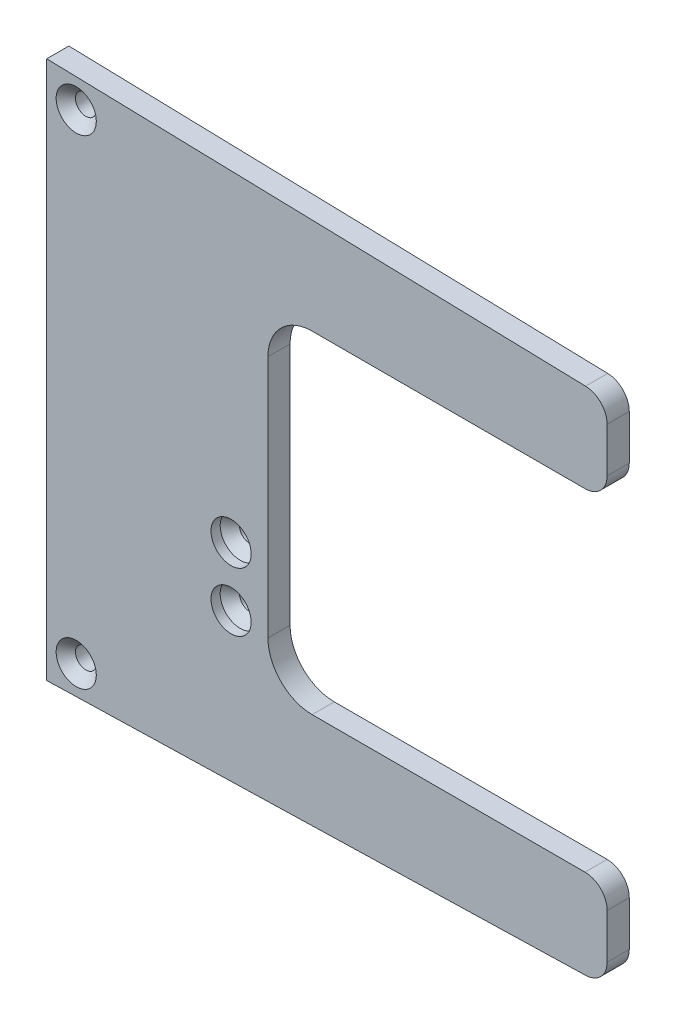
ISO-10303-21;
HEADER;
FILE_DESCRIPTION(('STEP AP214'),'2;1');
FILE_NAME('part.step','',(''),(''),'','','');
FILE_SCHEMA(('AUTOMOTIVE_DESIGN { 1 0 10303 214 1 1 1 1 }'));
ENDSEC;
DATA;
#1=APPLICATION_CONTEXT('core data for automotive mechanical design processes');
#2=APPLICATION_PROTOCOL_DEFINITION('international standard','automotive_design',2000,#1);
#3=PRODUCT_CONTEXT('',#1,'mechanical');
#4=PRODUCT('Part','Part','',(#3));
#5=PRODUCT_RELATED_PRODUCT_CATEGORY('part','',(#4));
#6=PRODUCT_DEFINITION_FORMATION('','',#4);
#7=PRODUCT_DEFINITION_CONTEXT('part definition',#1,'design');
#8=PRODUCT_DEFINITION('design','',#6,#7);
#9=PRODUCT_DEFINITION_SHAPE('','',#8);
#10=(LENGTH_UNIT() NAMED_UNIT(*) SI_UNIT(.MILLI.,.METRE.));
#11=(NAMED_UNIT(*) PLANE_ANGLE_UNIT() SI_UNIT($,.RADIAN.));
#12=(NAMED_UNIT(*) SI_UNIT($,.STERADIAN.) SOLID_ANGLE_UNIT());
#13=UNCERTAINTY_MEASURE_WITH_UNIT(LENGTH_MEASURE(1.E-05),#10,'distance_accuracy_value','');
#14=(GEOMETRIC_REPRESENTATION_CONTEXT(3) GLOBAL_UNCERTAINTY_ASSIGNED_CONTEXT((#13)) GLOBAL_UNIT_ASSIGNED_CONTEXT((#10,
#11,#12)) REPRESENTATION_CONTEXT('',''));
#15=CARTESIAN_POINT('',(0.,0.,0.));
#16=DIRECTION('',(0.,0.,1.));
#17=DIRECTION('',(1.,0.,0.));
#18=AXIS2_PLACEMENT_3D('',#15,#16,#17);
#19=CARTESIAN_POINT('',(-47.625,115.91925,9.525));
#20=DIRECTION('',(1.,0.,0.));
#21=DIRECTION('',(0.,1.,0.));
#22=AXIS2_PLACEMENT_3D('',#19,#20,#21);
#23=PLANE('',#22);
#24=DIRECTION('',(0.,-1.,0.));
#25=VECTOR('',#24,1.);
#26=CARTESIAN_POINT('',(-47.625,115.91925,0.));
#27=LINE('',#26,#25);
#28=CARTESIAN_POINT('',(-47.625,115.91925,0.));
#29=VERTEX_POINT('',#28);
#30=CARTESIAN_POINT('',(-47.625,-115.91925,0.));
#31=VERTEX_POINT('',#30);
#32=EDGE_CURVE('E167',#29,#31,#27,.T.);
#33=ORIENTED_EDGE('',*,*,#32,.T.);
#34=DIRECTION('',(0.,0.,-1.));
#35=VECTOR('',#34,1.);
#36=CARTESIAN_POINT('',(-47.625,-115.91925,9.525));
#37=LINE('',#36,#35);
#38=CARTESIAN_POINT('',(-47.625,-115.91925,9.525));
#39=VERTEX_POINT('',#38);
#40=EDGE_CURVE('E145',#39,#31,#37,.T.);
#41=ORIENTED_EDGE('',*,*,#40,.F.);
#42=DIRECTION('',(0.,-1.,0.));
#43=VECTOR('',#42,1.);
#44=CARTESIAN_POINT('',(-47.625,115.91925,9.525));
#45=LINE('',#44,#43);
#46=CARTESIAN_POINT('',(-47.625,115.91925,9.525));
#47=VERTEX_POINT('',#46);
#48=EDGE_CURVE('E155',#47,#39,#45,.T.);
#49=ORIENTED_EDGE('',*,*,#48,.F.);
#50=DIRECTION('',(0.,0.,-1.));
#51=VECTOR('',#50,1.);
#52=CARTESIAN_POINT('',(-47.625,115.91925,9.525));
#53=LINE('',#52,#51);
#54=EDGE_CURVE('E169',#47,#29,#53,.T.);
#55=ORIENTED_EDGE('',*,*,#54,.T.);
#56=EDGE_LOOP('',(#33,#41,#49,#55));
#57=FACE_BOUND('',#56,.T.);
#58=ADVANCED_FACE('F39',(#57),#23,.F.);
#59=CARTESIAN_POINT('',(47.625,115.91925,9.525));
#60=DIRECTION('',(-1.,0.,0.));
#61=DIRECTION('',(0.,-1.,0.));
#62=AXIS2_PLACEMENT_3D('',#59,#60,#61);
#63=PLANE('',#62);
#64=DIRECTION('',(0.,1.,0.));
#65=VECTOR('',#64,1.);
#66=CARTESIAN_POINT('',(47.625,115.91925,9.525));
#67=LINE('',#66,#65);
#68=CARTESIAN_POINT('',(47.625,-52.4505871253568,9.525));
#69=VERTEX_POINT('',#68);
#70=CARTESIAN_POINT('',(47.625,52.4505871253569,9.525));
#71=VERTEX_POINT('',#70);
#72=EDGE_CURVE('E162',#69,#71,#67,.T.);
#73=ORIENTED_EDGE('',*,*,#72,.F.);
#74=DIRECTION('',(0.,0.,1.));
#75=VECTOR('',#74,1.);
#76=CARTESIAN_POINT('',(47.625,-52.4505871253569,9.525));
#77=LINE('',#76,#75);
#78=CARTESIAN_POINT('',(47.625,-52.4505871253568,0.));
#79=VERTEX_POINT('',#78);
#80=EDGE_CURVE('E234',#69,#79,#77,.F.);
#81=ORIENTED_EDGE('',*,*,#80,.T.);
#82=DIRECTION('',(0.,1.,0.));
#83=VECTOR('',#82,1.);
#84=CARTESIAN_POINT('',(47.625,115.91925,0.));
#85=LINE('',#84,#83);
#86=CARTESIAN_POINT('',(47.625,52.4505871253569,0.));
#87=VERTEX_POINT('',#86);
#88=EDGE_CURVE('E163',#79,#87,#85,.T.);
#89=ORIENTED_EDGE('',*,*,#88,.T.);
#90=DIRECTION('',(0.,0.,1.));
#91=VECTOR('',#90,1.);
#92=CARTESIAN_POINT('',(47.625,52.4505871253569,9.525));
#93=LINE('',#92,#91);
#94=EDGE_CURVE('E230',#87,#71,#93,.T.);
#95=ORIENTED_EDGE('',*,*,#94,.T.);
#96=EDGE_LOOP('',(#73,#81,#89,#95));
#97=FACE_BOUND('',#96,.T.);
#98=ADVANCED_FACE('F270',(#97),#63,.F.);
#99=CARTESIAN_POINT('',(-47.625,-115.91925,9.525));
#100=DIRECTION('',(0.,0.,1.));
#101=DIRECTION('',(1.,0.,0.));
#102=AXIS2_PLACEMENT_3D('',#99,#100,#101);
#103=PLANE('',#102);
#104=DIRECTION('',(-0.999657324975558,-0.0261769483078661,0.));
#105=VECTOR('',#104,1.);
#106=CARTESIAN_POINT('',(47.625,-113.425040970536,9.525));
#107=LINE('',#106,#105);
#108=CARTESIAN_POINT('',(184.399335432632,-109.84347895022,9.525));
#109=VERTEX_POINT('',#108);
#110=EDGE_CURVE('E140',#109,#39,#107,.T.);
#111=ORIENTED_EDGE('',*,*,#110,.F.);
#112=CARTESIAN_POINT('',(184.15,-100.321742929828,9.525));
#113=DIRECTION('',(0.,0.,1.));
#114=DIRECTION('',(1.,0.,0.));
#115=AXIS2_PLACEMENT_3D('',#112,#113,#114);
#116=CIRCLE('',#115,9.525);
#117=CARTESIAN_POINT('',(193.675,-100.321742929828,9.525));
#118=VERTEX_POINT('',#117);
#119=EDGE_CURVE('E186',#109,#118,#116,.T.);
#120=ORIENTED_EDGE('',*,*,#119,.T.);
#121=DIRECTION('',(0.,1.,0.));
#122=VECTOR('',#121,1.);
#123=CARTESIAN_POINT('',(193.675,-71.5005871253569,9.525));
#124=LINE('',#123,#122);
#125=CARTESIAN_POINT('',(193.675,-81.0255871253569,9.525));
#126=VERTEX_POINT('',#125);
#127=EDGE_CURVE('E658',#118,#126,#124,.T.);
#128=ORIENTED_EDGE('',*,*,#127,.T.);
#129=CARTESIAN_POINT('',(184.15,-81.0255871253569,9.52500000000001));
#130=DIRECTION('',(0.,0.,1.));
#131=DIRECTION('',(1.,0.,0.));
#132=AXIS2_PLACEMENT_3D('',#129,#130,#131);
#133=CIRCLE('',#132,9.525);
#134=CARTESIAN_POINT('',(184.15,-71.5005871253569,9.525));
#135=VERTEX_POINT('',#134);
#136=EDGE_CURVE('E183',#126,#135,#133,.T.);
#137=ORIENTED_EDGE('',*,*,#136,.T.);
#138=DIRECTION('',(-1.,0.,0.));
#139=VECTOR('',#138,1.);
#140=CARTESIAN_POINT('',(47.625,-71.5005871253569,9.525));
#141=LINE('',#140,#139);
#142=CARTESIAN_POINT('',(66.675,-71.5005871253569,9.525));
#143=VERTEX_POINT('',#142);
#144=EDGE_CURVE('E268',#135,#143,#141,.T.);
#145=ORIENTED_EDGE('',*,*,#144,.T.);
#146=CARTESIAN_POINT('',(66.675,-52.4505871253569,9.52500000000001));
#147=DIRECTION('',(0.,0.,1.));
#148=DIRECTION('',(1.,0.,0.));
#149=AXIS2_PLACEMENT_3D('',#146,#147,#148);
#150=CIRCLE('',#149,19.05);
#151=EDGE_CURVE('E239',#143,#69,#150,.F.);
#152=ORIENTED_EDGE('',*,*,#151,.T.);
#153=ORIENTED_EDGE('',*,*,#72,.T.);
#154=CARTESIAN_POINT('',(66.675,52.4505871253569,9.525));
#155=DIRECTION('',(0.,0.,1.));
#156=DIRECTION('',(1.,0.,0.));
#157=AXIS2_PLACEMENT_3D('',#154,#155,#156);
#158=CIRCLE('',#157,19.05);
#159=CARTESIAN_POINT('',(66.675,71.5005871253569,9.525));
#160=VERTEX_POINT('',#159);
#161=EDGE_CURVE('E48',#71,#160,#158,.F.);
#162=ORIENTED_EDGE('',*,*,#161,.T.);
#163=DIRECTION('',(1.,0.,0.));
#164=VECTOR('',#163,1.);
#165=CARTESIAN_POINT('',(193.675,71.5005871253569,9.525));
#166=LINE('',#165,#164);
#167=CARTESIAN_POINT('',(184.15,71.5005871253569,9.525));
#168=VERTEX_POINT('',#167);
#169=EDGE_CURVE('E263',#160,#168,#166,.T.);
#170=ORIENTED_EDGE('',*,*,#169,.T.);
#171=CARTESIAN_POINT('',(184.15,81.0255871253569,9.52500000000001));
#172=DIRECTION('',(0.,0.,1.));
#173=DIRECTION('',(1.,0.,0.));
#174=AXIS2_PLACEMENT_3D('',#171,#172,#173);
#175=CIRCLE('',#174,9.525);
#176=CARTESIAN_POINT('',(193.675,81.0255871253569,9.525));
#177=VERTEX_POINT('',#176);
#178=EDGE_CURVE('E180',#168,#177,#175,.T.);
#179=ORIENTED_EDGE('',*,*,#178,.T.);
#180=DIRECTION('',(0.,1.,0.));
#181=VECTOR('',#180,1.);
#182=CARTESIAN_POINT('',(193.675,109.600587125357,9.525));
#183=LINE('',#182,#181);
#184=CARTESIAN_POINT('',(193.675,100.321742929828,9.525));
#185=VERTEX_POINT('',#184);
#186=EDGE_CURVE('E291',#177,#185,#183,.T.);
#187=ORIENTED_EDGE('',*,*,#186,.T.);
#188=CARTESIAN_POINT('',(184.15,100.321742929828,9.52500000000001));
#189=DIRECTION('',(0.,0.,1.));
#190=DIRECTION('',(1.,0.,0.));
#191=AXIS2_PLACEMENT_3D('',#188,#189,#190);
#192=CIRCLE('',#191,9.525);
#193=CARTESIAN_POINT('',(184.399335432632,109.84347895022,9.525));
#194=VERTEX_POINT('',#193);
#195=EDGE_CURVE('E173',#185,#194,#192,.T.);
#196=ORIENTED_EDGE('',*,*,#195,.T.);
#197=DIRECTION('',(0.999657324975557,-0.026176948307866,0.));
#198=VECTOR('',#197,1.);
#199=CARTESIAN_POINT('',(-47.625,115.91925,9.525));
#200=LINE('',#199,#198);
#201=EDGE_CURVE('E150',#47,#194,#200,.T.);
#202=ORIENTED_EDGE('',*,*,#201,.F.);
#203=ORIENTED_EDGE('',*,*,#48,.T.);
#204=EDGE_LOOP('',(#111,#120,#128,#137,#145,#152,#153,#162,#170,#179,#187,#196,#202,#203));
#205=FACE_BOUND('',#204,.T.);
#206=CARTESIAN_POINT('',(-34.925,103.21925,9.525));
#207=DIRECTION('',(0.,0.,1.));
#208=DIRECTION('',(1.,0.,0.));
#209=AXIS2_PLACEMENT_3D('',#206,#207,#208);
#210=CIRCLE('',#209,8.65);
#211=CARTESIAN_POINT('',(-26.275,103.21925,9.525));
#212=VERTEX_POINT('',#211);
#213=EDGE_CURVE('E301',#212,#212,#210,.T.);
#214=ORIENTED_EDGE('',*,*,#213,.F.);
#215=EDGE_LOOP('',(#214));
#216=FACE_BOUND('',#215,.T.);
#217=CARTESIAN_POINT('',(-34.925,-103.21925,9.525));
#218=DIRECTION('',(0.,0.,1.));
#219=DIRECTION('',(1.,0.,0.));
#220=AXIS2_PLACEMENT_3D('',#217,#218,#219);
#221=CIRCLE('',#220,8.65);
#222=CARTESIAN_POINT('',(-26.275,-103.21925,9.525));
#223=VERTEX_POINT('',#222);
#224=EDGE_CURVE('E313',#223,#223,#221,.T.);
#225=ORIENTED_EDGE('',*,*,#224,.F.);
#226=EDGE_LOOP('',(#225));
#227=FACE_BOUND('',#226,.T.);
#228=CARTESIAN_POINT('',(31.75,-50.15865,9.525));
#229=DIRECTION('',(0.,0.,1.));
#230=DIRECTION('',(1.,0.,0.));
#231=AXIS2_PLACEMENT_3D('',#228,#229,#230);
#232=CIRCLE('',#231,8.65);
#233=CARTESIAN_POINT('',(40.4,-50.15865,9.525));
#234=VERTEX_POINT('',#233);
#235=EDGE_CURVE('E337',#234,#234,#232,.T.);
#236=ORIENTED_EDGE('',*,*,#235,.F.);
#237=EDGE_LOOP('',(#236));
#238=FACE_BOUND('',#237,.T.);
#239=CARTESIAN_POINT('',(31.75,-24.75865,9.525));
#240=DIRECTION('',(0.,0.,1.));
#241=DIRECTION('',(1.,0.,0.));
#242=AXIS2_PLACEMENT_3D('',#239,#240,#241);
#243=CIRCLE('',#242,8.65);
#244=CARTESIAN_POINT('',(40.4,-24.75865,9.525));
#245=VERTEX_POINT('',#244);
#246=EDGE_CURVE('E277',#245,#245,#243,.T.);
#247=ORIENTED_EDGE('',*,*,#246,.F.);
#248=EDGE_LOOP('',(#247));
#249=FACE_BOUND('',#248,.T.);
#250=ADVANCED_FACE('F156',(#205,#216,#227,#238,#249),#103,.T.);
#251=CARTESIAN_POINT('',(-47.625,-115.91925,0.));
#252=DIRECTION('',(0.,0.,1.));
#253=DIRECTION('',(1.,0.,0.));
#254=AXIS2_PLACEMENT_3D('',#251,#252,#253);
#255=PLANE('',#254);
#256=CARTESIAN_POINT('',(-34.925,103.21925,0.));
#257=DIRECTION('',(0.,0.,1.));
#258=DIRECTION('',(1.,0.,0.));
#259=AXIS2_PLACEMENT_3D('',#256,#257,#258);
#260=CIRCLE('',#259,4.49999999999999);
#261=CARTESIAN_POINT('',(-30.425,103.21925,0.));
#262=VERTEX_POINT('',#261);
#263=EDGE_CURVE('E309',#262,#262,#260,.T.);
#264=ORIENTED_EDGE('',*,*,#263,.T.);
#265=EDGE_LOOP('',(#264));
#266=FACE_BOUND('',#265,.T.);
#267=CARTESIAN_POINT('',(-34.925,-103.21925,0.));
#268=DIRECTION('',(0.,0.,1.));
#269=DIRECTION('',(1.,0.,0.));
#270=AXIS2_PLACEMENT_3D('',#267,#268,#269);
#271=CIRCLE('',#270,4.49999999999999);
#272=CARTESIAN_POINT('',(-30.425,-103.21925,0.));
#273=VERTEX_POINT('',#272);
#274=EDGE_CURVE('E321',#273,#273,#271,.T.);
#275=ORIENTED_EDGE('',*,*,#274,.T.);
#276=EDGE_LOOP('',(#275));
#277=FACE_BOUND('',#276,.T.);
#278=CARTESIAN_POINT('',(31.75,-50.15865,0.));
#279=DIRECTION('',(0.,0.,1.));
#280=DIRECTION('',(1.,0.,0.));
#281=AXIS2_PLACEMENT_3D('',#278,#279,#280);
#282=CIRCLE('',#281,4.5);
#283=CARTESIAN_POINT('',(36.25,-50.15865,0.));
#284=VERTEX_POINT('',#283);
#285=EDGE_CURVE('E325',#284,#284,#282,.T.);
#286=ORIENTED_EDGE('',*,*,#285,.T.);
#287=EDGE_LOOP('',(#286));
#288=FACE_BOUND('',#287,.T.);
#289=CARTESIAN_POINT('',(31.75,-24.75865,0.));
#290=DIRECTION('',(0.,0.,1.));
#291=DIRECTION('',(1.,0.,0.));
#292=AXIS2_PLACEMENT_3D('',#289,#290,#291);
#293=CIRCLE('',#292,4.5);
#294=CARTESIAN_POINT('',(36.25,-24.75865,0.));
#295=VERTEX_POINT('',#294);
#296=EDGE_CURVE('E341',#295,#295,#293,.T.);
#297=ORIENTED_EDGE('',*,*,#296,.T.);
#298=EDGE_LOOP('',(#297));
#299=FACE_BOUND('',#298,.T.);
#300=DIRECTION('',(0.,-1.,0.));
#301=VECTOR('',#300,1.);
#302=CARTESIAN_POINT('',(193.675,-71.5005871253569,0.));
#303=LINE('',#302,#301);
#304=CARTESIAN_POINT('',(193.675,-81.0255871253569,0.));
#305=VERTEX_POINT('',#304);
#306=CARTESIAN_POINT('',(193.675,-100.321742929828,0.));
#307=VERTEX_POINT('',#306);
#308=EDGE_CURVE('E264',#305,#307,#303,.T.);
#309=ORIENTED_EDGE('',*,*,#308,.T.);
#310=CARTESIAN_POINT('',(184.15,-100.321742929828,0.));
#311=DIRECTION('',(0.,0.,1.));
#312=DIRECTION('',(1.,0.,0.));
#313=AXIS2_PLACEMENT_3D('',#310,#311,#312);
#314=CIRCLE('',#313,9.525);
#315=CARTESIAN_POINT('',(184.399335432632,-109.84347895022,0.));
#316=VERTEX_POINT('',#315);
#317=EDGE_CURVE('E205',#307,#316,#314,.F.);
#318=ORIENTED_EDGE('',*,*,#317,.T.);
#319=DIRECTION('',(0.999657324975558,0.0261769483078661,0.));
#320=VECTOR('',#319,1.);
#321=CARTESIAN_POINT('',(47.625,-113.425040970536,0.));
#322=LINE('',#321,#320);
#323=EDGE_CURVE('E151',#31,#316,#322,.T.);
#324=ORIENTED_EDGE('',*,*,#323,.F.);
#325=ORIENTED_EDGE('',*,*,#32,.F.);
#326=DIRECTION('',(-0.999657324975558,0.026176948307866,0.));
#327=VECTOR('',#326,1.);
#328=CARTESIAN_POINT('',(-47.625,115.91925,0.));
#329=LINE('',#328,#327);
#330=CARTESIAN_POINT('',(184.399335432632,109.84347895022,0.));
#331=VERTEX_POINT('',#330);
#332=EDGE_CURVE('E298',#331,#29,#329,.T.);
#333=ORIENTED_EDGE('',*,*,#332,.F.);
#334=CARTESIAN_POINT('',(184.15,100.321742929828,0.));
#335=DIRECTION('',(0.,0.,1.));
#336=DIRECTION('',(1.,0.,0.));
#337=AXIS2_PLACEMENT_3D('',#334,#335,#336);
#338=CIRCLE('',#337,9.525);
#339=CARTESIAN_POINT('',(193.675,100.321742929828,0.));
#340=VERTEX_POINT('',#339);
#341=EDGE_CURVE('E196',#331,#340,#338,.F.);
#342=ORIENTED_EDGE('',*,*,#341,.T.);
#343=DIRECTION('',(0.,-1.,0.));
#344=VECTOR('',#343,1.);
#345=CARTESIAN_POINT('',(193.675,109.600587125357,0.));
#346=LINE('',#345,#344);
#347=CARTESIAN_POINT('',(193.675,81.0255871253569,0.));
#348=VERTEX_POINT('',#347);
#349=EDGE_CURVE('E286',#340,#348,#346,.T.);
#350=ORIENTED_EDGE('',*,*,#349,.T.);
#351=CARTESIAN_POINT('',(184.15,81.0255871253569,0.));
#352=DIRECTION('',(0.,0.,1.));
#353=DIRECTION('',(1.,0.,0.));
#354=AXIS2_PLACEMENT_3D('',#351,#352,#353);
#355=CIRCLE('',#354,9.525);
#356=CARTESIAN_POINT('',(184.15,71.5005871253569,0.));
#357=VERTEX_POINT('',#356);
#358=EDGE_CURVE('E199',#348,#357,#355,.F.);
#359=ORIENTED_EDGE('',*,*,#358,.T.);
#360=DIRECTION('',(-1.,0.,0.));
#361=VECTOR('',#360,1.);
#362=CARTESIAN_POINT('',(193.675,71.5005871253569,0.));
#363=LINE('',#362,#361);
#364=CARTESIAN_POINT('',(66.675,71.5005871253569,0.));
#365=VERTEX_POINT('',#364);
#366=EDGE_CURVE('E281',#357,#365,#363,.T.);
#367=ORIENTED_EDGE('',*,*,#366,.T.);
#368=CARTESIAN_POINT('',(66.675,52.4505871253569,0.));
#369=DIRECTION('',(0.,0.,1.));
#370=DIRECTION('',(1.,0.,0.));
#371=AXIS2_PLACEMENT_3D('',#368,#369,#370);
#372=CIRCLE('',#371,19.05);
#373=EDGE_CURVE('E11',#365,#87,#372,.T.);
#374=ORIENTED_EDGE('',*,*,#373,.T.);
#375=ORIENTED_EDGE('',*,*,#88,.F.);
#376=CARTESIAN_POINT('',(66.675,-52.4505871253569,0.));
#377=DIRECTION('',(0.,0.,1.));
#378=DIRECTION('',(1.,0.,0.));
#379=AXIS2_PLACEMENT_3D('',#376,#377,#378);
#380=CIRCLE('',#379,19.05);
#381=CARTESIAN_POINT('',(66.675,-71.5005871253569,0.));
#382=VERTEX_POINT('',#381);
#383=EDGE_CURVE('E242',#79,#382,#380,.T.);
#384=ORIENTED_EDGE('',*,*,#383,.T.);
#385=DIRECTION('',(1.,0.,0.));
#386=VECTOR('',#385,1.);
#387=CARTESIAN_POINT('',(47.625,-71.5005871253569,0.));
#388=LINE('',#387,#386);
#389=CARTESIAN_POINT('',(184.15,-71.5005871253569,0.));
#390=VERTEX_POINT('',#389);
#391=EDGE_CURVE('E251',#382,#390,#388,.T.);
#392=ORIENTED_EDGE('',*,*,#391,.T.);
#393=CARTESIAN_POINT('',(184.15,-81.0255871253569,0.));
#394=DIRECTION('',(0.,0.,1.));
#395=DIRECTION('',(1.,0.,0.));
#396=AXIS2_PLACEMENT_3D('',#393,#394,#395);
#397=CIRCLE('',#396,9.525);
#398=EDGE_CURVE('E202',#390,#305,#397,.F.);
#399=ORIENTED_EDGE('',*,*,#398,.T.);
#400=EDGE_LOOP('',(#309,#318,#324,#325,#333,#342,#350,#359,#367,#374,#375,#384,#392,#399));
#401=FACE_BOUND('',#400,.T.);
#402=ADVANCED_FACE('F250',(#266,#277,#288,#299,#401),#255,.F.);
#403=CARTESIAN_POINT('',(31.75,-24.75865,9.525));
#404=DIRECTION('',(0.,0.,1.));
#405=DIRECTION('',(1.,0.,0.));
#406=AXIS2_PLACEMENT_3D('',#403,#404,#405);
#407=CYLINDRICAL_SURFACE('',#406,8.65);
#408=CARTESIAN_POINT('',(31.75,-24.75865,5.5626));
#409=DIRECTION('',(0.,0.,1.));
#410=DIRECTION('',(1.,0.,0.));
#411=AXIS2_PLACEMENT_3D('',#408,#409,#410);
#412=CIRCLE('',#411,8.65);
#413=CARTESIAN_POINT('',(40.4,-24.75865,5.5626));
#414=VERTEX_POINT('',#413);
#415=EDGE_CURVE('E349',#414,#414,#412,.T.);
#416=ORIENTED_EDGE('',*,*,#415,.F.);
#417=EDGE_LOOP('',(#416));
#418=FACE_BOUND('',#417,.T.);
#419=ORIENTED_EDGE('',*,*,#246,.T.);
#420=EDGE_LOOP('',(#419));
#421=FACE_BOUND('',#420,.T.);
#422=ADVANCED_FACE('F356',(#418,#421),#407,.F.);
#423=CARTESIAN_POINT('',(31.75,-24.75865,5.5626));
#424=DIRECTION('',(0.,0.,1.));
#425=DIRECTION('',(1.,0.,0.));
#426=AXIS2_PLACEMENT_3D('',#423,#424,#425);
#427=CONICAL_SURFACE('',#426,8.65,0.785398163397449);
#428=CARTESIAN_POINT('',(31.75,-24.75865,1.41260000000001));
#429=DIRECTION('',(0.,0.,1.));
#430=DIRECTION('',(1.,0.,0.));
#431=AXIS2_PLACEMENT_3D('',#428,#429,#430);
#432=CIRCLE('',#431,4.5);
#433=CARTESIAN_POINT('',(36.25,-24.75865,1.41260000000001));
#434=VERTEX_POINT('',#433);
#435=EDGE_CURVE('E345',#434,#434,#432,.T.);
#436=ORIENTED_EDGE('',*,*,#435,.F.);
#437=EDGE_LOOP('',(#436));
#438=FACE_BOUND('',#437,.T.);
#439=ORIENTED_EDGE('',*,*,#415,.T.);
#440=EDGE_LOOP('',(#439));
#441=FACE_BOUND('',#440,.T.);
#442=ADVANCED_FACE('F583',(#438,#441),#427,.F.);
#443=CARTESIAN_POINT('',(31.75,-24.75865,9.525));
#444=DIRECTION('',(0.,0.,1.));
#445=DIRECTION('',(1.,0.,0.));
#446=AXIS2_PLACEMENT_3D('',#443,#444,#445);
#447=CYLINDRICAL_SURFACE('',#446,4.5);
#448=ORIENTED_EDGE('',*,*,#296,.F.);
#449=EDGE_LOOP('',(#448));
#450=FACE_BOUND('',#449,.T.);
#451=ORIENTED_EDGE('',*,*,#435,.T.);
#452=EDGE_LOOP('',(#451));
#453=FACE_BOUND('',#452,.T.);
#454=ADVANCED_FACE('F573',(#450,#453),#447,.F.);
#455=CARTESIAN_POINT('',(31.75,-50.15865,9.525));
#456=DIRECTION('',(0.,0.,1.));
#457=DIRECTION('',(1.,0.,0.));
#458=AXIS2_PLACEMENT_3D('',#455,#456,#457);
#459=CYLINDRICAL_SURFACE('',#458,8.65);
#460=CARTESIAN_POINT('',(31.75,-50.15865,5.5626));
#461=DIRECTION('',(0.,0.,1.));
#462=DIRECTION('',(1.,0.,0.));
#463=AXIS2_PLACEMENT_3D('',#460,#461,#462);
#464=CIRCLE('',#463,8.65);
#465=CARTESIAN_POINT('',(40.4,-50.15865,5.5626));
#466=VERTEX_POINT('',#465);
#467=EDGE_CURVE('E333',#466,#466,#464,.T.);
#468=ORIENTED_EDGE('',*,*,#467,.F.);
#469=EDGE_LOOP('',(#468));
#470=FACE_BOUND('',#469,.T.);
#471=ORIENTED_EDGE('',*,*,#235,.T.);
#472=EDGE_LOOP('',(#471));
#473=FACE_BOUND('',#472,.T.);
#474=ADVANCED_FACE('F563',(#470,#473),#459,.F.);
#475=CARTESIAN_POINT('',(31.75,-50.15865,5.5626));
#476=DIRECTION('',(0.,0.,1.));
#477=DIRECTION('',(1.,0.,0.));
#478=AXIS2_PLACEMENT_3D('',#475,#476,#477);
#479=CONICAL_SURFACE('',#478,8.65,0.785398163397449);
#480=CARTESIAN_POINT('',(31.75,-50.15865,1.41260000000001));
#481=DIRECTION('',(0.,0.,1.));
#482=DIRECTION('',(1.,0.,0.));
#483=AXIS2_PLACEMENT_3D('',#480,#481,#482);
#484=CIRCLE('',#483,4.5);
#485=CARTESIAN_POINT('',(36.25,-50.15865,1.41260000000001));
#486=VERTEX_POINT('',#485);
#487=EDGE_CURVE('E329',#486,#486,#484,.T.);
#488=ORIENTED_EDGE('',*,*,#487,.F.);
#489=EDGE_LOOP('',(#488));
#490=FACE_BOUND('',#489,.T.);
#491=ORIENTED_EDGE('',*,*,#467,.T.);
#492=EDGE_LOOP('',(#491));
#493=FACE_BOUND('',#492,.T.);
#494=ADVANCED_FACE('F553',(#490,#493),#479,.F.);
#495=CARTESIAN_POINT('',(31.75,-50.15865,9.525));
#496=DIRECTION('',(0.,0.,1.));
#497=DIRECTION('',(1.,0.,0.));
#498=AXIS2_PLACEMENT_3D('',#495,#496,#497);
#499=CYLINDRICAL_SURFACE('',#498,4.5);
#500=ORIENTED_EDGE('',*,*,#285,.F.);
#501=EDGE_LOOP('',(#500));
#502=FACE_BOUND('',#501,.T.);
#503=ORIENTED_EDGE('',*,*,#487,.T.);
#504=EDGE_LOOP('',(#503));
#505=FACE_BOUND('',#504,.T.);
#506=ADVANCED_FACE('F543',(#502,#505),#499,.F.);
#507=CARTESIAN_POINT('',(-34.925,-103.21925,9.525));
#508=DIRECTION('',(0.,0.,1.));
#509=DIRECTION('',(1.,0.,0.));
#510=AXIS2_PLACEMENT_3D('',#507,#508,#509);
#511=CYLINDRICAL_SURFACE('',#510,4.49999999999999);
#512=ORIENTED_EDGE('',*,*,#274,.F.);
#513=EDGE_LOOP('',(#512));
#514=FACE_BOUND('',#513,.T.);
#515=CARTESIAN_POINT('',(-34.925,-103.21925,5.375));
#516=DIRECTION('',(0.,0.,1.));
#517=DIRECTION('',(1.,0.,0.));
#518=AXIS2_PLACEMENT_3D('',#515,#516,#517);
#519=CIRCLE('',#518,4.5);
#520=CARTESIAN_POINT('',(-30.425,-103.21925,5.375));
#521=VERTEX_POINT('',#520);
#522=EDGE_CURVE('E317',#521,#521,#519,.T.);
#523=ORIENTED_EDGE('',*,*,#522,.T.);
#524=EDGE_LOOP('',(#523));
#525=FACE_BOUND('',#524,.T.);
#526=ADVANCED_FACE('F533',(#514,#525),#511,.F.);
#527=CARTESIAN_POINT('',(-34.925,-103.21925,9.525));
#528=DIRECTION('',(0.,0.,1.));
#529=DIRECTION('',(1.,0.,0.));
#530=AXIS2_PLACEMENT_3D('',#527,#528,#529);
#531=CONICAL_SURFACE('',#530,8.65,0.785398163397448);
#532=ORIENTED_EDGE('',*,*,#522,.F.);
#533=EDGE_LOOP('',(#532));
#534=FACE_BOUND('',#533,.T.);
#535=ORIENTED_EDGE('',*,*,#224,.T.);
#536=EDGE_LOOP('',(#535));
#537=FACE_BOUND('',#536,.T.);
#538=ADVANCED_FACE('F523',(#534,#537),#531,.F.);
#539=CARTESIAN_POINT('',(-34.925,103.21925,9.525));
#540=DIRECTION('',(0.,0.,1.));
#541=DIRECTION('',(1.,0.,0.));
#542=AXIS2_PLACEMENT_3D('',#539,#540,#541);
#543=CYLINDRICAL_SURFACE('',#542,4.49999999999999);
#544=ORIENTED_EDGE('',*,*,#263,.F.);
#545=EDGE_LOOP('',(#544));
#546=FACE_BOUND('',#545,.T.);
#547=CARTESIAN_POINT('',(-34.925,103.21925,5.375));
#548=DIRECTION('',(0.,0.,1.));
#549=DIRECTION('',(1.,0.,0.));
#550=AXIS2_PLACEMENT_3D('',#547,#548,#549);
#551=CIRCLE('',#550,4.5);
#552=CARTESIAN_POINT('',(-30.425,103.21925,5.375));
#553=VERTEX_POINT('',#552);
#554=EDGE_CURVE('E305',#553,#553,#551,.T.);
#555=ORIENTED_EDGE('',*,*,#554,.T.);
#556=EDGE_LOOP('',(#555));
#557=FACE_BOUND('',#556,.T.);
#558=ADVANCED_FACE('F513',(#546,#557),#543,.F.);
#559=CARTESIAN_POINT('',(-34.925,103.21925,9.525));
#560=DIRECTION('',(0.,0.,1.));
#561=DIRECTION('',(1.,0.,0.));
#562=AXIS2_PLACEMENT_3D('',#559,#560,#561);
#563=CONICAL_SURFACE('',#562,8.65,0.785398163397448);
#564=ORIENTED_EDGE('',*,*,#554,.F.);
#565=EDGE_LOOP('',(#564));
#566=FACE_BOUND('',#565,.T.);
#567=ORIENTED_EDGE('',*,*,#213,.T.);
#568=EDGE_LOOP('',(#567));
#569=FACE_BOUND('',#568,.T.);
#570=ADVANCED_FACE('F498',(#566,#569),#563,.F.);
#571=CARTESIAN_POINT('',(-47.625,115.91925,-0.00100000000000447));
#572=DIRECTION('',(-0.026176948307866,-0.999657324975557,0.));
#573=DIRECTION('',(0.999657324975558,-0.026176948307866,0.));
#574=AXIS2_PLACEMENT_3D('',#571,#572,#573);
#575=PLANE('',#574);
#576=ORIENTED_EDGE('',*,*,#201,.T.);
#577=DIRECTION('',(0.,0.,1.));
#578=VECTOR('',#577,1.);
#579=CARTESIAN_POINT('',(184.399335432632,109.84347895022,0.));
#580=LINE('',#579,#578);
#581=EDGE_CURVE('E223',#194,#331,#580,.F.);
#582=ORIENTED_EDGE('',*,*,#581,.T.);
#583=ORIENTED_EDGE('',*,*,#332,.T.);
#584=ORIENTED_EDGE('',*,*,#54,.F.);
#585=EDGE_LOOP('',(#576,#582,#583,#584));
#586=FACE_BOUND('',#585,.T.);
#587=ADVANCED_FACE('F490',(#586),#575,.F.);
#588=CARTESIAN_POINT('',(47.625,-113.425040970536,-0.00100000000000447));
#589=DIRECTION('',(-0.0261769483078661,0.999657324975557,0.));
#590=DIRECTION('',(-0.999657324975558,-0.0261769483078661,0.));
#591=AXIS2_PLACEMENT_3D('',#588,#589,#590);
#592=PLANE('',#591);
#593=ORIENTED_EDGE('',*,*,#323,.T.);
#594=DIRECTION('',(0.,0.,1.));
#595=VECTOR('',#594,1.);
#596=CARTESIAN_POINT('',(184.399335432632,-109.84347895022,9.525));
#597=LINE('',#596,#595);
#598=EDGE_CURVE('E148',#316,#109,#597,.T.);
#599=ORIENTED_EDGE('',*,*,#598,.T.);
#600=ORIENTED_EDGE('',*,*,#110,.T.);
#601=ORIENTED_EDGE('',*,*,#40,.T.);
#602=EDGE_LOOP('',(#593,#599,#600,#601));
#603=FACE_BOUND('',#602,.T.);
#604=ADVANCED_FACE('F143',(#603),#592,.F.);
#605=CARTESIAN_POINT('',(193.675,109.600587125357,-151.948222530626));
#606=DIRECTION('',(1.,0.,0.));
#607=DIRECTION('',(0.,0.,-1.));
#608=AXIS2_PLACEMENT_3D('',#605,#606,#607);
#609=PLANE('',#608);
#610=ORIENTED_EDGE('',*,*,#186,.F.);
#611=DIRECTION('',(0.,0.,1.));
#612=VECTOR('',#611,1.);
#613=CARTESIAN_POINT('',(193.675,81.0255871253569,-151.948222530626));
#614=LINE('',#613,#612);
#615=EDGE_CURVE('E220',#177,#348,#614,.F.);
#616=ORIENTED_EDGE('',*,*,#615,.T.);
#617=ORIENTED_EDGE('',*,*,#349,.F.);
#618=DIRECTION('',(0.,0.,1.));
#619=VECTOR('',#618,1.);
#620=CARTESIAN_POINT('',(193.675,100.321742929828,9.52500000000001));
#621=LINE('',#620,#619);
#622=EDGE_CURVE('E216',#340,#185,#621,.T.);
#623=ORIENTED_EDGE('',*,*,#622,.T.);
#624=EDGE_LOOP('',(#610,#616,#617,#623));
#625=FACE_BOUND('',#624,.T.);
#626=ADVANCED_FACE('F420',(#625),#609,.T.);
#627=CARTESIAN_POINT('',(193.675,71.5005871253569,-151.948222530626));
#628=DIRECTION('',(0.,-1.,0.));
#629=DIRECTION('',(1.,0.,0.));
#630=AXIS2_PLACEMENT_3D('',#627,#628,#629);
#631=PLANE('',#630);
#632=ORIENTED_EDGE('',*,*,#169,.F.);
#633=DIRECTION('',(0.,0.,1.));
#634=VECTOR('',#633,1.);
#635=CARTESIAN_POINT('',(66.675,71.5005871253569,-151.948222530626));
#636=LINE('',#635,#634);
#637=EDGE_CURVE('E61',#160,#365,#636,.F.);
#638=ORIENTED_EDGE('',*,*,#637,.T.);
#639=ORIENTED_EDGE('',*,*,#366,.F.);
#640=DIRECTION('',(0.,0.,1.));
#641=VECTOR('',#640,1.);
#642=CARTESIAN_POINT('',(184.15,71.5005871253569,-151.948222530626));
#643=LINE('',#642,#641);
#644=EDGE_CURVE('E212',#357,#168,#643,.T.);
#645=ORIENTED_EDGE('',*,*,#644,.T.);
#646=EDGE_LOOP('',(#632,#638,#639,#645));
#647=FACE_BOUND('',#646,.T.);
#648=ADVANCED_FACE('F409',(#647),#631,.T.);
#649=CARTESIAN_POINT('',(47.625,-71.5005871253569,-151.948222530626));
#650=DIRECTION('',(0.,1.,0.));
#651=DIRECTION('',(0.,0.,1.));
#652=AXIS2_PLACEMENT_3D('',#649,#650,#651);
#653=PLANE('',#652);
#654=ORIENTED_EDGE('',*,*,#391,.F.);
#655=DIRECTION('',(0.,0.,1.));
#656=VECTOR('',#655,1.);
#657=CARTESIAN_POINT('',(66.675,-71.5005871253569,-151.948222530626));
#658=LINE('',#657,#656);
#659=EDGE_CURVE('E226',#382,#143,#658,.T.);
#660=ORIENTED_EDGE('',*,*,#659,.T.);
#661=ORIENTED_EDGE('',*,*,#144,.F.);
#662=DIRECTION('',(0.,0.,1.));
#663=VECTOR('',#662,1.);
#664=CARTESIAN_POINT('',(184.15,-71.5005871253569,-151.948222530626));
#665=LINE('',#664,#663);
#666=EDGE_CURVE('E208',#135,#390,#665,.F.);
#667=ORIENTED_EDGE('',*,*,#666,.T.);
#668=EDGE_LOOP('',(#654,#660,#661,#667));
#669=FACE_BOUND('',#668,.T.);
#670=ADVANCED_FACE('F257',(#669),#653,.T.);
#671=CARTESIAN_POINT('',(193.675,-71.5005871253569,-151.948222530626));
#672=DIRECTION('',(1.,0.,0.));
#673=DIRECTION('',(0.,1.,0.));
#674=AXIS2_PLACEMENT_3D('',#671,#672,#673);
#675=PLANE('',#674);
#676=ORIENTED_EDGE('',*,*,#127,.F.);
#677=DIRECTION('',(0.,0.,1.));
#678=VECTOR('',#677,1.);
#679=CARTESIAN_POINT('',(193.675,-100.321742929828,0.));
#680=LINE('',#679,#678);
#681=EDGE_CURVE('E193',#118,#307,#680,.F.);
#682=ORIENTED_EDGE('',*,*,#681,.T.);
#683=ORIENTED_EDGE('',*,*,#308,.F.);
#684=DIRECTION('',(0.,0.,1.));
#685=VECTOR('',#684,1.);
#686=CARTESIAN_POINT('',(193.675,-81.0255871253569,-151.948222530626));
#687=LINE('',#686,#685);
#688=EDGE_CURVE('E189',#305,#126,#687,.T.);
#689=ORIENTED_EDGE('',*,*,#688,.T.);
#690=EDGE_LOOP('',(#676,#682,#683,#689));
#691=FACE_BOUND('',#690,.T.);
#692=ADVANCED_FACE('F377',(#691),#675,.T.);
#693=CARTESIAN_POINT('',(184.15,-100.321742929828,-0.00100000000000447));
#694=DIRECTION('',(0.,0.,-1.));
#695=DIRECTION('',(-1.,0.,0.));
#696=AXIS2_PLACEMENT_3D('',#693,#694,#695);
#697=CYLINDRICAL_SURFACE('',#696,9.525);
#698=ORIENTED_EDGE('',*,*,#317,.F.);
#699=ORIENTED_EDGE('',*,*,#681,.F.);
#700=ORIENTED_EDGE('',*,*,#119,.F.);
#701=ORIENTED_EDGE('',*,*,#598,.F.);
#702=EDGE_LOOP('',(#698,#699,#700,#701));
#703=FACE_BOUND('',#702,.T.);
#704=ADVANCED_FACE('F373',(#703),#697,.T.);
#705=CARTESIAN_POINT('',(184.15,-81.0255871253569,-151.948222530626));
#706=DIRECTION('',(0.,0.,1.));
#707=DIRECTION('',(1.,0.,0.));
#708=AXIS2_PLACEMENT_3D('',#705,#706,#707);
#709=CYLINDRICAL_SURFACE('',#708,9.525);
#710=ORIENTED_EDGE('',*,*,#398,.F.);
#711=ORIENTED_EDGE('',*,*,#666,.F.);
#712=ORIENTED_EDGE('',*,*,#136,.F.);
#713=ORIENTED_EDGE('',*,*,#688,.F.);
#714=EDGE_LOOP('',(#710,#711,#712,#713));
#715=FACE_BOUND('',#714,.T.);
#716=ADVANCED_FACE('F376',(#715),#709,.T.);
#717=CARTESIAN_POINT('',(184.15,81.0255871253569,-151.948222530626));
#718=DIRECTION('',(0.,0.,1.));
#719=DIRECTION('',(1.,0.,0.));
#720=AXIS2_PLACEMENT_3D('',#717,#718,#719);
#721=CYLINDRICAL_SURFACE('',#720,9.525);
#722=ORIENTED_EDGE('',*,*,#358,.F.);
#723=ORIENTED_EDGE('',*,*,#615,.F.);
#724=ORIENTED_EDGE('',*,*,#178,.F.);
#725=ORIENTED_EDGE('',*,*,#644,.F.);
#726=EDGE_LOOP('',(#722,#723,#724,#725));
#727=FACE_BOUND('',#726,.T.);
#728=ADVANCED_FACE('F381',(#727),#721,.T.);
#729=CARTESIAN_POINT('',(184.15,100.321742929828,-151.948222530626));
#730=DIRECTION('',(0.,0.,-1.));
#731=DIRECTION('',(-1.,0.,0.));
#732=AXIS2_PLACEMENT_3D('',#729,#730,#731);
#733=CYLINDRICAL_SURFACE('',#732,9.525);
#734=ORIENTED_EDGE('',*,*,#341,.F.);
#735=ORIENTED_EDGE('',*,*,#581,.F.);
#736=ORIENTED_EDGE('',*,*,#195,.F.);
#737=ORIENTED_EDGE('',*,*,#622,.F.);
#738=EDGE_LOOP('',(#734,#735,#736,#737));
#739=FACE_BOUND('',#738,.T.);
#740=ADVANCED_FACE('F385',(#739),#733,.T.);
#741=CARTESIAN_POINT('',(66.675,-52.4505871253569,-151.948222530626));
#742=DIRECTION('',(0.,0.,1.));
#743=DIRECTION('',(1.,0.,0.));
#744=AXIS2_PLACEMENT_3D('',#741,#742,#743);
#745=CYLINDRICAL_SURFACE('',#744,19.05);
#746=ORIENTED_EDGE('',*,*,#383,.F.);
#747=ORIENTED_EDGE('',*,*,#80,.F.);
#748=ORIENTED_EDGE('',*,*,#151,.F.);
#749=ORIENTED_EDGE('',*,*,#659,.F.);
#750=EDGE_LOOP('',(#746,#747,#748,#749));
#751=FACE_BOUND('',#750,.T.);
#752=ADVANCED_FACE('F266',(#751),#745,.F.);
#753=CARTESIAN_POINT('',(66.675,52.4505871253569,9.525));
#754=DIRECTION('',(0.,0.,1.));
#755=DIRECTION('',(1.,0.,0.));
#756=AXIS2_PLACEMENT_3D('',#753,#754,#755);
#757=CYLINDRICAL_SURFACE('',#756,19.05);
#758=ORIENTED_EDGE('',*,*,#373,.F.);
#759=ORIENTED_EDGE('',*,*,#637,.F.);
#760=ORIENTED_EDGE('',*,*,#161,.F.);
#761=ORIENTED_EDGE('',*,*,#94,.F.);
#762=EDGE_LOOP('',(#758,#759,#760,#761));
#763=FACE_BOUND('',#762,.T.);
#764=ADVANCED_FACE('F41',(#763),#757,.F.);
#765=CLOSED_SHELL('',(#58,#98,#250,#402,#422,#442,#454,#474,#494,#506,#526,#538,#558,#570,#587,
#604,#626,#648,#670,#692,#704,#716,#728,#740,#752,#764));
#766=MANIFOLD_SOLID_BREP('B2',#765);
#767=ADVANCED_BREP_SHAPE_REPRESENTATION('',(#18,#766),#14);
#768=SHAPE_DEFINITION_REPRESENTATION(#9,#767);
ENDSEC;
END-ISO-10303-21;
